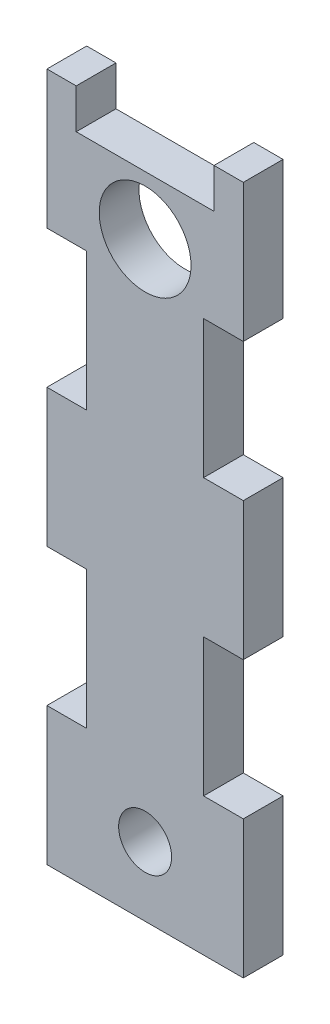
ISO-10303-21;
HEADER;
FILE_DESCRIPTION(('STEP AP214'),'2;1');
FILE_NAME('part.step','',(''),(''),'','','');
FILE_SCHEMA(('AUTOMOTIVE_DESIGN { 1 0 10303 214 1 1 1 1 }'));
ENDSEC;
DATA;
#1=APPLICATION_CONTEXT('core data for automotive mechanical design processes');
#2=APPLICATION_PROTOCOL_DEFINITION('international standard','automotive_design',2000,#1);
#3=PRODUCT_CONTEXT('',#1,'mechanical');
#4=PRODUCT('Part','Part','',(#3));
#5=PRODUCT_RELATED_PRODUCT_CATEGORY('part','',(#4));
#6=PRODUCT_DEFINITION_FORMATION('','',#4);
#7=PRODUCT_DEFINITION_CONTEXT('part definition',#1,'design');
#8=PRODUCT_DEFINITION('design','',#6,#7);
#9=PRODUCT_DEFINITION_SHAPE('','',#8);
#10=(LENGTH_UNIT() NAMED_UNIT(*) SI_UNIT(.MILLI.,.METRE.));
#11=(NAMED_UNIT(*) PLANE_ANGLE_UNIT() SI_UNIT($,.RADIAN.));
#12=(NAMED_UNIT(*) SI_UNIT($,.STERADIAN.) SOLID_ANGLE_UNIT());
#13=UNCERTAINTY_MEASURE_WITH_UNIT(LENGTH_MEASURE(1.E-05),#10,'distance_accuracy_value','');
#14=(GEOMETRIC_REPRESENTATION_CONTEXT(3) GLOBAL_UNCERTAINTY_ASSIGNED_CONTEXT((#13)) GLOBAL_UNIT_ASSIGNED_CONTEXT((#10,
#11,#12)) REPRESENTATION_CONTEXT('',''));
#15=CARTESIAN_POINT('',(0.,0.,0.));
#16=DIRECTION('',(0.,0.,1.));
#17=DIRECTION('',(1.,0.,0.));
#18=AXIS2_PLACEMENT_3D('',#15,#16,#17);
#19=CARTESIAN_POINT('',(0.,-9.525,9.525));
#20=DIRECTION('',(0.,1.,0.));
#21=DIRECTION('',(0.,0.,1.));
#22=AXIS2_PLACEMENT_3D('',#19,#20,#21);
#23=PLANE('',#22);
#24=DIRECTION('',(1.,0.,0.));
#25=VECTOR('',#24,1.);
#26=CARTESIAN_POINT('',(0.,-9.525,0.));
#27=LINE('',#26,#25);
#28=CARTESIAN_POINT('',(7.01499994,-9.525,0.));
#29=VERTEX_POINT('',#28);
#30=CARTESIAN_POINT('',(40.03499994,-9.525,0.));
#31=VERTEX_POINT('',#30);
#32=EDGE_CURVE('E238',#29,#31,#27,.T.);
#33=ORIENTED_EDGE('',*,*,#32,.F.);
#34=DIRECTION('',(0.,0.,-1.));
#35=VECTOR('',#34,1.);
#36=CARTESIAN_POINT('',(7.01499994,-9.525,9.525));
#37=LINE('',#36,#35);
#38=CARTESIAN_POINT('',(7.01499994,-9.525,9.525));
#39=VERTEX_POINT('',#38);
#40=EDGE_CURVE('E11',#39,#29,#37,.T.);
#41=ORIENTED_EDGE('',*,*,#40,.F.);
#42=DIRECTION('',(1.,0.,0.));
#43=VECTOR('',#42,1.);
#44=CARTESIAN_POINT('',(0.,-9.525,9.525));
#45=LINE('',#44,#43);
#46=CARTESIAN_POINT('',(40.03499994,-9.525,9.525));
#47=VERTEX_POINT('',#46);
#48=EDGE_CURVE('E421',#39,#47,#45,.T.);
#49=ORIENTED_EDGE('',*,*,#48,.T.);
#50=DIRECTION('',(0.,0.,-1.));
#51=VECTOR('',#50,1.);
#52=CARTESIAN_POINT('',(40.03499994,-9.525,9.525));
#53=LINE('',#52,#51);
#54=EDGE_CURVE('E139',#47,#31,#53,.T.);
#55=ORIENTED_EDGE('',*,*,#54,.T.);
#56=EDGE_LOOP('',(#33,#41,#49,#55));
#57=FACE_BOUND('',#56,.T.);
#58=ADVANCED_FACE('F38',(#57),#23,.T.);
#59=CARTESIAN_POINT('',(7.01499994,0.,9.525));
#60=DIRECTION('',(1.,0.,0.));
#61=DIRECTION('',(0.,1.,0.));
#62=AXIS2_PLACEMENT_3D('',#59,#60,#61);
#63=PLANE('',#62);
#64=DIRECTION('',(0.,-1.,0.));
#65=VECTOR('',#64,1.);
#66=CARTESIAN_POINT('',(7.01499994,0.,0.));
#67=LINE('',#66,#65);
#68=CARTESIAN_POINT('',(7.01499994,0.,0.));
#69=VERTEX_POINT('',#68);
#70=EDGE_CURVE('E242',#69,#29,#67,.T.);
#71=ORIENTED_EDGE('',*,*,#70,.F.);
#72=DIRECTION('',(0.,0.,-1.));
#73=VECTOR('',#72,1.);
#74=CARTESIAN_POINT('',(7.01499994,0.,9.525));
#75=LINE('',#74,#73);
#76=CARTESIAN_POINT('',(7.01499994,0.,9.525));
#77=VERTEX_POINT('',#76);
#78=EDGE_CURVE('E49',#77,#69,#75,.T.);
#79=ORIENTED_EDGE('',*,*,#78,.F.);
#80=DIRECTION('',(0.,-1.,0.));
#81=VECTOR('',#80,1.);
#82=CARTESIAN_POINT('',(7.01499994,0.,9.525));
#83=LINE('',#82,#81);
#84=EDGE_CURVE('E417',#77,#39,#83,.T.);
#85=ORIENTED_EDGE('',*,*,#84,.T.);
#86=ORIENTED_EDGE('',*,*,#40,.T.);
#87=EDGE_LOOP('',(#71,#79,#85,#86));
#88=FACE_BOUND('',#87,.T.);
#89=ADVANCED_FACE('F403',(#88),#63,.T.);
#90=CARTESIAN_POINT('',(0.,0.,9.525));
#91=DIRECTION('',(0.,1.,0.));
#92=DIRECTION('',(0.,0.,1.));
#93=AXIS2_PLACEMENT_3D('',#90,#91,#92);
#94=PLANE('',#93);
#95=DIRECTION('',(1.,0.,0.));
#96=VECTOR('',#95,1.);
#97=CARTESIAN_POINT('',(0.,0.,0.));
#98=LINE('',#97,#96);
#99=CARTESIAN_POINT('',(0.,0.,0.));
#100=VERTEX_POINT('',#99);
#101=EDGE_CURVE('E246',#100,#69,#98,.T.);
#102=ORIENTED_EDGE('',*,*,#101,.F.);
#103=DIRECTION('',(0.,0.,-1.));
#104=VECTOR('',#103,1.);
#105=CARTESIAN_POINT('',(0.,0.,9.525));
#106=LINE('',#105,#104);
#107=CARTESIAN_POINT('',(0.,0.,9.525));
#108=VERTEX_POINT('',#107);
#109=EDGE_CURVE('E389',#108,#100,#106,.T.);
#110=ORIENTED_EDGE('',*,*,#109,.F.);
#111=DIRECTION('',(1.,0.,0.));
#112=VECTOR('',#111,1.);
#113=CARTESIAN_POINT('',(0.,0.,9.525));
#114=LINE('',#113,#112);
#115=EDGE_CURVE('E399',#108,#77,#114,.T.);
#116=ORIENTED_EDGE('',*,*,#115,.T.);
#117=ORIENTED_EDGE('',*,*,#78,.T.);
#118=EDGE_LOOP('',(#102,#110,#116,#117));
#119=FACE_BOUND('',#118,.T.);
#120=ADVANCED_FACE('F397',(#119),#94,.T.);
#121=CARTESIAN_POINT('',(0.,0.,9.525));
#122=DIRECTION('',(1.,0.,0.));
#123=DIRECTION('',(0.,1.,0.));
#124=AXIS2_PLACEMENT_3D('',#121,#122,#123);
#125=PLANE('',#124);
#126=DIRECTION('',(0.,-1.,0.));
#127=VECTOR('',#126,1.);
#128=CARTESIAN_POINT('',(0.,0.,0.));
#129=LINE('',#128,#127);
#130=CARTESIAN_POINT('',(0.,-33.02,0.));
#131=VERTEX_POINT('',#130);
#132=EDGE_CURVE('E250',#100,#131,#129,.T.);
#133=ORIENTED_EDGE('',*,*,#132,.T.);
#134=DIRECTION('',(0.,0.,-1.));
#135=VECTOR('',#134,1.);
#136=CARTESIAN_POINT('',(0.,-33.02,9.525));
#137=LINE('',#136,#135);
#138=CARTESIAN_POINT('',(0.,-33.02,9.525));
#139=VERTEX_POINT('',#138);
#140=EDGE_CURVE('E385',#139,#131,#137,.T.);
#141=ORIENTED_EDGE('',*,*,#140,.F.);
#142=DIRECTION('',(0.,-1.,0.));
#143=VECTOR('',#142,1.);
#144=CARTESIAN_POINT('',(0.,0.,9.525));
#145=LINE('',#144,#143);
#146=EDGE_CURVE('E412',#108,#139,#145,.T.);
#147=ORIENTED_EDGE('',*,*,#146,.F.);
#148=ORIENTED_EDGE('',*,*,#109,.T.);
#149=EDGE_LOOP('',(#133,#141,#147,#148));
#150=FACE_BOUND('',#149,.T.);
#151=ADVANCED_FACE('F409',(#150),#125,.F.);
#152=CARTESIAN_POINT('',(0.,-33.02,9.525));
#153=DIRECTION('',(0.,1.,0.));
#154=DIRECTION('',(0.,0.,1.));
#155=AXIS2_PLACEMENT_3D('',#152,#153,#154);
#156=PLANE('',#155);
#157=DIRECTION('',(1.,0.,0.));
#158=VECTOR('',#157,1.);
#159=CARTESIAN_POINT('',(0.,-33.02,0.));
#160=LINE('',#159,#158);
#161=CARTESIAN_POINT('',(9.525,-33.02,0.));
#162=VERTEX_POINT('',#161);
#163=EDGE_CURVE('E254',#131,#162,#160,.T.);
#164=ORIENTED_EDGE('',*,*,#163,.T.);
#165=DIRECTION('',(0.,0.,-1.));
#166=VECTOR('',#165,1.);
#167=CARTESIAN_POINT('',(9.525,-33.02,9.525));
#168=LINE('',#167,#166);
#169=CARTESIAN_POINT('',(9.525,-33.02,9.525));
#170=VERTEX_POINT('',#169);
#171=EDGE_CURVE('E381',#170,#162,#168,.T.);
#172=ORIENTED_EDGE('',*,*,#171,.F.);
#173=DIRECTION('',(1.,0.,0.));
#174=VECTOR('',#173,1.);
#175=CARTESIAN_POINT('',(0.,-33.02,9.525));
#176=LINE('',#175,#174);
#177=EDGE_CURVE('E415',#139,#170,#176,.T.);
#178=ORIENTED_EDGE('',*,*,#177,.F.);
#179=ORIENTED_EDGE('',*,*,#140,.T.);
#180=EDGE_LOOP('',(#164,#172,#178,#179));
#181=FACE_BOUND('',#180,.T.);
#182=ADVANCED_FACE('F519',(#181),#156,.F.);
#183=CARTESIAN_POINT('',(9.525,0.,9.525));
#184=DIRECTION('',(1.,0.,0.));
#185=DIRECTION('',(0.,1.,0.));
#186=AXIS2_PLACEMENT_3D('',#183,#184,#185);
#187=PLANE('',#186);
#188=DIRECTION('',(0.,-1.,0.));
#189=VECTOR('',#188,1.);
#190=CARTESIAN_POINT('',(9.525,0.,0.));
#191=LINE('',#190,#189);
#192=CARTESIAN_POINT('',(9.52500000000001,-66.04,0.));
#193=VERTEX_POINT('',#192);
#194=EDGE_CURVE('E258',#162,#193,#191,.T.);
#195=ORIENTED_EDGE('',*,*,#194,.T.);
#196=DIRECTION('',(0.,0.,-1.));
#197=VECTOR('',#196,1.);
#198=CARTESIAN_POINT('',(9.52500000000001,-66.04,9.525));
#199=LINE('',#198,#197);
#200=CARTESIAN_POINT('',(9.52500000000001,-66.04,9.525));
#201=VERTEX_POINT('',#200);
#202=EDGE_CURVE('E377',#201,#193,#199,.T.);
#203=ORIENTED_EDGE('',*,*,#202,.F.);
#204=DIRECTION('',(0.,-1.,0.));
#205=VECTOR('',#204,1.);
#206=CARTESIAN_POINT('',(9.525,0.,9.525));
#207=LINE('',#206,#205);
#208=EDGE_CURVE('E427',#170,#201,#207,.T.);
#209=ORIENTED_EDGE('',*,*,#208,.F.);
#210=ORIENTED_EDGE('',*,*,#171,.T.);
#211=EDGE_LOOP('',(#195,#203,#209,#210));
#212=FACE_BOUND('',#211,.T.);
#213=ADVANCED_FACE('F522',(#212),#187,.F.);
#214=CARTESIAN_POINT('',(0.,-66.04,9.525));
#215=DIRECTION('',(0.,-1.,0.));
#216=DIRECTION('',(0.,0.,-1.));
#217=AXIS2_PLACEMENT_3D('',#214,#215,#216);
#218=PLANE('',#217);
#219=DIRECTION('',(-1.,0.,0.));
#220=VECTOR('',#219,1.);
#221=CARTESIAN_POINT('',(0.,-66.04,0.));
#222=LINE('',#221,#220);
#223=CARTESIAN_POINT('',(0.,-66.04,0.));
#224=VERTEX_POINT('',#223);
#225=EDGE_CURVE('E262',#193,#224,#222,.T.);
#226=ORIENTED_EDGE('',*,*,#225,.T.);
#227=DIRECTION('',(0.,0.,-1.));
#228=VECTOR('',#227,1.);
#229=CARTESIAN_POINT('',(0.,-66.04,9.525));
#230=LINE('',#229,#228);
#231=CARTESIAN_POINT('',(0.,-66.04,9.525));
#232=VERTEX_POINT('',#231);
#233=EDGE_CURVE('E373',#232,#224,#230,.T.);
#234=ORIENTED_EDGE('',*,*,#233,.F.);
#235=DIRECTION('',(-1.,0.,0.));
#236=VECTOR('',#235,1.);
#237=CARTESIAN_POINT('',(0.,-66.04,9.525));
#238=LINE('',#237,#236);
#239=EDGE_CURVE('E431',#201,#232,#238,.T.);
#240=ORIENTED_EDGE('',*,*,#239,.F.);
#241=ORIENTED_EDGE('',*,*,#202,.T.);
#242=EDGE_LOOP('',(#226,#234,#240,#241));
#243=FACE_BOUND('',#242,.T.);
#244=ADVANCED_FACE('F526',(#243),#218,.F.);
#245=CARTESIAN_POINT('',(0.,0.,9.525));
#246=DIRECTION('',(1.,0.,0.));
#247=DIRECTION('',(0.,1.,0.));
#248=AXIS2_PLACEMENT_3D('',#245,#246,#247);
#249=PLANE('',#248);
#250=DIRECTION('',(0.,-1.,0.));
#251=VECTOR('',#250,1.);
#252=CARTESIAN_POINT('',(0.,0.,0.));
#253=LINE('',#252,#251);
#254=CARTESIAN_POINT('',(0.,-99.06,0.));
#255=VERTEX_POINT('',#254);
#256=EDGE_CURVE('E266',#224,#255,#253,.T.);
#257=ORIENTED_EDGE('',*,*,#256,.T.);
#258=DIRECTION('',(0.,0.,-1.));
#259=VECTOR('',#258,1.);
#260=CARTESIAN_POINT('',(0.,-99.06,9.525));
#261=LINE('',#260,#259);
#262=CARTESIAN_POINT('',(0.,-99.06,9.525));
#263=VERTEX_POINT('',#262);
#264=EDGE_CURVE('E370',#263,#255,#261,.T.);
#265=ORIENTED_EDGE('',*,*,#264,.F.);
#266=DIRECTION('',(0.,-1.,0.));
#267=VECTOR('',#266,1.);
#268=CARTESIAN_POINT('',(0.,0.,9.525));
#269=LINE('',#268,#267);
#270=EDGE_CURVE('E435',#232,#263,#269,.T.);
#271=ORIENTED_EDGE('',*,*,#270,.F.);
#272=ORIENTED_EDGE('',*,*,#233,.T.);
#273=EDGE_LOOP('',(#257,#265,#271,#272));
#274=FACE_BOUND('',#273,.T.);
#275=ADVANCED_FACE('F530',(#274),#249,.F.);
#276=CARTESIAN_POINT('',(0.,-99.06,9.525));
#277=DIRECTION('',(0.,-1.,0.));
#278=DIRECTION('',(0.,0.,-1.));
#279=AXIS2_PLACEMENT_3D('',#276,#277,#278);
#280=PLANE('',#279);
#281=DIRECTION('',(-1.,0.,0.));
#282=VECTOR('',#281,1.);
#283=CARTESIAN_POINT('',(0.,-99.06,0.));
#284=LINE('',#283,#282);
#285=CARTESIAN_POINT('',(9.52500000000002,-99.06,0.));
#286=VERTEX_POINT('',#285);
#287=EDGE_CURVE('E270',#286,#255,#284,.T.);
#288=ORIENTED_EDGE('',*,*,#287,.F.);
#289=DIRECTION('',(0.,0.,-1.));
#290=VECTOR('',#289,1.);
#291=CARTESIAN_POINT('',(9.52500000000002,-99.06,9.525));
#292=LINE('',#291,#290);
#293=CARTESIAN_POINT('',(9.52500000000002,-99.06,9.525));
#294=VERTEX_POINT('',#293);
#295=EDGE_CURVE('E367',#294,#286,#292,.T.);
#296=ORIENTED_EDGE('',*,*,#295,.F.);
#297=DIRECTION('',(-1.,0.,0.));
#298=VECTOR('',#297,1.);
#299=CARTESIAN_POINT('',(0.,-99.06,9.525));
#300=LINE('',#299,#298);
#301=EDGE_CURVE('E438',#294,#263,#300,.T.);
#302=ORIENTED_EDGE('',*,*,#301,.T.);
#303=ORIENTED_EDGE('',*,*,#264,.T.);
#304=EDGE_LOOP('',(#288,#296,#302,#303));
#305=FACE_BOUND('',#304,.T.);
#306=ADVANCED_FACE('F532',(#305),#280,.T.);
#307=CARTESIAN_POINT('',(9.52500000000002,0.,9.525));
#308=DIRECTION('',(-1.,0.,0.));
#309=DIRECTION('',(0.,0.,1.));
#310=AXIS2_PLACEMENT_3D('',#307,#308,#309);
#311=PLANE('',#310);
#312=DIRECTION('',(0.,1.,0.));
#313=VECTOR('',#312,1.);
#314=CARTESIAN_POINT('',(9.52500000000002,0.,0.));
#315=LINE('',#314,#313);
#316=CARTESIAN_POINT('',(9.52500000000002,-132.08,0.));
#317=VERTEX_POINT('',#316);
#318=EDGE_CURVE('E275',#317,#286,#315,.T.);
#319=ORIENTED_EDGE('',*,*,#318,.F.);
#320=DIRECTION('',(0.,0.,-1.));
#321=VECTOR('',#320,1.);
#322=CARTESIAN_POINT('',(9.52500000000002,-132.08,9.525));
#323=LINE('',#322,#321);
#324=CARTESIAN_POINT('',(9.52500000000002,-132.08,9.525));
#325=VERTEX_POINT('',#324);
#326=EDGE_CURVE('E364',#325,#317,#323,.T.);
#327=ORIENTED_EDGE('',*,*,#326,.F.);
#328=DIRECTION('',(0.,1.,0.));
#329=VECTOR('',#328,1.);
#330=CARTESIAN_POINT('',(9.52500000000002,0.,9.525));
#331=LINE('',#330,#329);
#332=EDGE_CURVE('E443',#325,#294,#331,.T.);
#333=ORIENTED_EDGE('',*,*,#332,.T.);
#334=ORIENTED_EDGE('',*,*,#295,.T.);
#335=EDGE_LOOP('',(#319,#327,#333,#334));
#336=FACE_BOUND('',#335,.T.);
#337=ADVANCED_FACE('F535',(#336),#311,.T.);
#338=CARTESIAN_POINT('',(0.,-132.08,9.525));
#339=DIRECTION('',(0.,1.,0.));
#340=DIRECTION('',(0.,0.,1.));
#341=AXIS2_PLACEMENT_3D('',#338,#339,#340);
#342=PLANE('',#341);
#343=DIRECTION('',(1.,0.,0.));
#344=VECTOR('',#343,1.);
#345=CARTESIAN_POINT('',(0.,-132.08,0.));
#346=LINE('',#345,#344);
#347=CARTESIAN_POINT('',(0.,-132.08,0.));
#348=VERTEX_POINT('',#347);
#349=EDGE_CURVE('E279',#348,#317,#346,.T.);
#350=ORIENTED_EDGE('',*,*,#349,.F.);
#351=DIRECTION('',(0.,0.,-1.));
#352=VECTOR('',#351,1.);
#353=CARTESIAN_POINT('',(0.,-132.08,9.525));
#354=LINE('',#353,#352);
#355=CARTESIAN_POINT('',(0.,-132.08,9.525));
#356=VERTEX_POINT('',#355);
#357=EDGE_CURVE('E361',#356,#348,#354,.T.);
#358=ORIENTED_EDGE('',*,*,#357,.F.);
#359=DIRECTION('',(1.,0.,0.));
#360=VECTOR('',#359,1.);
#361=CARTESIAN_POINT('',(0.,-132.08,9.525));
#362=LINE('',#361,#360);
#363=EDGE_CURVE('E447',#356,#325,#362,.T.);
#364=ORIENTED_EDGE('',*,*,#363,.T.);
#365=ORIENTED_EDGE('',*,*,#326,.T.);
#366=EDGE_LOOP('',(#350,#358,#364,#365));
#367=FACE_BOUND('',#366,.T.);
#368=ADVANCED_FACE('F539',(#367),#342,.T.);
#369=CARTESIAN_POINT('',(0.,-165.1,0.));
#370=VERTEX_POINT('',#369);
#371=EDGE_CURVE('E271',#348,#370,#253,.T.);
#372=ORIENTED_EDGE('',*,*,#371,.T.);
#373=DIRECTION('',(0.,0.,-1.));
#374=VECTOR('',#373,1.);
#375=CARTESIAN_POINT('',(0.,-165.1,9.525));
#376=LINE('',#375,#374);
#377=CARTESIAN_POINT('',(0.,-165.1,9.525));
#378=VERTEX_POINT('',#377);
#379=EDGE_CURVE('E357',#378,#370,#376,.T.);
#380=ORIENTED_EDGE('',*,*,#379,.F.);
#381=EDGE_CURVE('E439',#356,#378,#269,.T.);
#382=ORIENTED_EDGE('',*,*,#381,.F.);
#383=ORIENTED_EDGE('',*,*,#357,.T.);
#384=EDGE_LOOP('',(#372,#380,#382,#383));
#385=FACE_BOUND('',#384,.T.);
#386=ADVANCED_FACE('F543',(#385),#249,.F.);
#387=CARTESIAN_POINT('',(0.,-165.1,9.525));
#388=DIRECTION('',(0.,1.,0.));
#389=DIRECTION('',(0.,0.,1.));
#390=AXIS2_PLACEMENT_3D('',#387,#388,#389);
#391=PLANE('',#390);
#392=DIRECTION('',(1.,0.,0.));
#393=VECTOR('',#392,1.);
#394=CARTESIAN_POINT('',(0.,-165.1,0.));
#395=LINE('',#394,#393);
#396=CARTESIAN_POINT('',(47.05,-165.1,0.));
#397=VERTEX_POINT('',#396);
#398=EDGE_CURVE('E283',#370,#397,#395,.T.);
#399=ORIENTED_EDGE('',*,*,#398,.T.);
#400=DIRECTION('',(0.,0.,-1.));
#401=VECTOR('',#400,1.);
#402=CARTESIAN_POINT('',(47.05,-165.1,9.525));
#403=LINE('',#402,#401);
#404=CARTESIAN_POINT('',(47.05,-165.1,9.525));
#405=VERTEX_POINT('',#404);
#406=EDGE_CURVE('E354',#405,#397,#403,.T.);
#407=ORIENTED_EDGE('',*,*,#406,.F.);
#408=DIRECTION('',(1.,0.,0.));
#409=VECTOR('',#408,1.);
#410=CARTESIAN_POINT('',(0.,-165.1,9.525));
#411=LINE('',#410,#409);
#412=EDGE_CURVE('E451',#378,#405,#411,.T.);
#413=ORIENTED_EDGE('',*,*,#412,.F.);
#414=ORIENTED_EDGE('',*,*,#379,.T.);
#415=EDGE_LOOP('',(#399,#407,#413,#414));
#416=FACE_BOUND('',#415,.T.);
#417=ADVANCED_FACE('F547',(#416),#391,.F.);
#418=CARTESIAN_POINT('',(47.05,0.,9.525));
#419=DIRECTION('',(1.,0.,0.));
#420=DIRECTION('',(0.,1.,0.));
#421=AXIS2_PLACEMENT_3D('',#418,#419,#420);
#422=PLANE('',#421);
#423=DIRECTION('',(0.,-1.,0.));
#424=VECTOR('',#423,1.);
#425=CARTESIAN_POINT('',(47.05,0.,0.));
#426=LINE('',#425,#424);
#427=CARTESIAN_POINT('',(47.05,-132.08,0.));
#428=VERTEX_POINT('',#427);
#429=EDGE_CURVE('E287',#428,#397,#426,.T.);
#430=ORIENTED_EDGE('',*,*,#429,.F.);
#431=DIRECTION('',(0.,0.,-1.));
#432=VECTOR('',#431,1.);
#433=CARTESIAN_POINT('',(47.05,-132.08,9.525));
#434=LINE('',#433,#432);
#435=CARTESIAN_POINT('',(47.05,-132.08,9.525));
#436=VERTEX_POINT('',#435);
#437=EDGE_CURVE('E351',#436,#428,#434,.T.);
#438=ORIENTED_EDGE('',*,*,#437,.F.);
#439=DIRECTION('',(0.,-1.,0.));
#440=VECTOR('',#439,1.);
#441=CARTESIAN_POINT('',(47.05,0.,9.525));
#442=LINE('',#441,#440);
#443=EDGE_CURVE('E454',#436,#405,#442,.T.);
#444=ORIENTED_EDGE('',*,*,#443,.T.);
#445=ORIENTED_EDGE('',*,*,#406,.T.);
#446=EDGE_LOOP('',(#430,#438,#444,#445));
#447=FACE_BOUND('',#446,.T.);
#448=ADVANCED_FACE('F551',(#447),#422,.T.);
#449=CARTESIAN_POINT('',(0.,-132.08,9.525));
#450=DIRECTION('',(0.,-1.,0.));
#451=DIRECTION('',(0.,0.,-1.));
#452=AXIS2_PLACEMENT_3D('',#449,#450,#451);
#453=PLANE('',#452);
#454=DIRECTION('',(-1.,0.,0.));
#455=VECTOR('',#454,1.);
#456=CARTESIAN_POINT('',(0.,-132.08,0.));
#457=LINE('',#456,#455);
#458=CARTESIAN_POINT('',(37.525,-132.08,0.));
#459=VERTEX_POINT('',#458);
#460=EDGE_CURVE('E291',#428,#459,#457,.T.);
#461=ORIENTED_EDGE('',*,*,#460,.T.);
#462=DIRECTION('',(0.,0.,-1.));
#463=VECTOR('',#462,1.);
#464=CARTESIAN_POINT('',(37.525,-132.08,9.525));
#465=LINE('',#464,#463);
#466=CARTESIAN_POINT('',(37.525,-132.08,9.525));
#467=VERTEX_POINT('',#466);
#468=EDGE_CURVE('E347',#467,#459,#465,.T.);
#469=ORIENTED_EDGE('',*,*,#468,.F.);
#470=DIRECTION('',(-1.,0.,0.));
#471=VECTOR('',#470,1.);
#472=CARTESIAN_POINT('',(0.,-132.08,9.525));
#473=LINE('',#472,#471);
#474=EDGE_CURVE('E458',#436,#467,#473,.T.);
#475=ORIENTED_EDGE('',*,*,#474,.F.);
#476=ORIENTED_EDGE('',*,*,#437,.T.);
#477=EDGE_LOOP('',(#461,#469,#475,#476));
#478=FACE_BOUND('',#477,.T.);
#479=ADVANCED_FACE('F553',(#478),#453,.F.);
#480=CARTESIAN_POINT('',(37.525,0.,9.525));
#481=DIRECTION('',(-1.,0.,0.));
#482=DIRECTION('',(0.,-1.,0.));
#483=AXIS2_PLACEMENT_3D('',#480,#481,#482);
#484=PLANE('',#483);
#485=DIRECTION('',(0.,1.,0.));
#486=VECTOR('',#485,1.);
#487=CARTESIAN_POINT('',(37.525,0.,0.));
#488=LINE('',#487,#486);
#489=CARTESIAN_POINT('',(37.525,-99.06,0.));
#490=VERTEX_POINT('',#489);
#491=EDGE_CURVE('E296',#459,#490,#488,.T.);
#492=ORIENTED_EDGE('',*,*,#491,.T.);
#493=DIRECTION('',(0.,0.,-1.));
#494=VECTOR('',#493,1.);
#495=CARTESIAN_POINT('',(37.525,-99.06,9.525));
#496=LINE('',#495,#494);
#497=CARTESIAN_POINT('',(37.525,-99.06,9.525));
#498=VERTEX_POINT('',#497);
#499=EDGE_CURVE('E343',#498,#490,#496,.T.);
#500=ORIENTED_EDGE('',*,*,#499,.F.);
#501=DIRECTION('',(0.,1.,0.));
#502=VECTOR('',#501,1.);
#503=CARTESIAN_POINT('',(37.525,0.,9.525));
#504=LINE('',#503,#502);
#505=EDGE_CURVE('E463',#467,#498,#504,.T.);
#506=ORIENTED_EDGE('',*,*,#505,.F.);
#507=ORIENTED_EDGE('',*,*,#468,.T.);
#508=EDGE_LOOP('',(#492,#500,#506,#507));
#509=FACE_BOUND('',#508,.T.);
#510=ADVANCED_FACE('F556',(#509),#484,.F.);
#511=CARTESIAN_POINT('',(0.,-99.06,9.525));
#512=DIRECTION('',(0.,1.,0.));
#513=DIRECTION('',(0.,0.,1.));
#514=AXIS2_PLACEMENT_3D('',#511,#512,#513);
#515=PLANE('',#514);
#516=DIRECTION('',(1.,0.,0.));
#517=VECTOR('',#516,1.);
#518=CARTESIAN_POINT('',(0.,-99.06,0.));
#519=LINE('',#518,#517);
#520=CARTESIAN_POINT('',(47.05,-99.06,0.));
#521=VERTEX_POINT('',#520);
#522=EDGE_CURVE('E300',#490,#521,#519,.T.);
#523=ORIENTED_EDGE('',*,*,#522,.T.);
#524=DIRECTION('',(0.,0.,-1.));
#525=VECTOR('',#524,1.);
#526=CARTESIAN_POINT('',(47.05,-99.06,9.525));
#527=LINE('',#526,#525);
#528=CARTESIAN_POINT('',(47.05,-99.06,9.525));
#529=VERTEX_POINT('',#528);
#530=EDGE_CURVE('E340',#529,#521,#527,.T.);
#531=ORIENTED_EDGE('',*,*,#530,.F.);
#532=DIRECTION('',(1.,0.,0.));
#533=VECTOR('',#532,1.);
#534=CARTESIAN_POINT('',(0.,-99.06,9.525));
#535=LINE('',#534,#533);
#536=EDGE_CURVE('E467',#498,#529,#535,.T.);
#537=ORIENTED_EDGE('',*,*,#536,.F.);
#538=ORIENTED_EDGE('',*,*,#499,.T.);
#539=EDGE_LOOP('',(#523,#531,#537,#538));
#540=FACE_BOUND('',#539,.T.);
#541=ADVANCED_FACE('F560',(#540),#515,.F.);
#542=CARTESIAN_POINT('',(47.05,-66.04,0.));
#543=VERTEX_POINT('',#542);
#544=EDGE_CURVE('E292',#543,#521,#426,.T.);
#545=ORIENTED_EDGE('',*,*,#544,.F.);
#546=DIRECTION('',(0.,0.,-1.));
#547=VECTOR('',#546,1.);
#548=CARTESIAN_POINT('',(47.05,-66.04,9.525));
#549=LINE('',#548,#547);
#550=CARTESIAN_POINT('',(47.05,-66.04,9.525));
#551=VERTEX_POINT('',#550);
#552=EDGE_CURVE('E337',#551,#543,#549,.T.);
#553=ORIENTED_EDGE('',*,*,#552,.F.);
#554=EDGE_CURVE('E459',#551,#529,#442,.T.);
#555=ORIENTED_EDGE('',*,*,#554,.T.);
#556=ORIENTED_EDGE('',*,*,#530,.T.);
#557=EDGE_LOOP('',(#545,#553,#555,#556));
#558=FACE_BOUND('',#557,.T.);
#559=ADVANCED_FACE('F564',(#558),#422,.T.);
#560=CARTESIAN_POINT('',(0.,-66.04,9.525));
#561=DIRECTION('',(0.,1.,0.));
#562=DIRECTION('',(0.,0.,1.));
#563=AXIS2_PLACEMENT_3D('',#560,#561,#562);
#564=PLANE('',#563);
#565=DIRECTION('',(1.,0.,0.));
#566=VECTOR('',#565,1.);
#567=CARTESIAN_POINT('',(0.,-66.04,0.));
#568=LINE('',#567,#566);
#569=CARTESIAN_POINT('',(37.525,-66.04,0.));
#570=VERTEX_POINT('',#569);
#571=EDGE_CURVE('E304',#570,#543,#568,.T.);
#572=ORIENTED_EDGE('',*,*,#571,.F.);
#573=DIRECTION('',(0.,0.,-1.));
#574=VECTOR('',#573,1.);
#575=CARTESIAN_POINT('',(37.525,-66.04,9.525));
#576=LINE('',#575,#574);
#577=CARTESIAN_POINT('',(37.525,-66.04,9.525));
#578=VERTEX_POINT('',#577);
#579=EDGE_CURVE('E334',#578,#570,#576,.T.);
#580=ORIENTED_EDGE('',*,*,#579,.F.);
#581=DIRECTION('',(1.,0.,0.));
#582=VECTOR('',#581,1.);
#583=CARTESIAN_POINT('',(0.,-66.04,9.525));
#584=LINE('',#583,#582);
#585=EDGE_CURVE('E470',#578,#551,#584,.T.);
#586=ORIENTED_EDGE('',*,*,#585,.T.);
#587=ORIENTED_EDGE('',*,*,#552,.T.);
#588=EDGE_LOOP('',(#572,#580,#586,#587));
#589=FACE_BOUND('',#588,.T.);
#590=ADVANCED_FACE('F568',(#589),#564,.T.);
#591=CARTESIAN_POINT('',(37.525,0.,9.525));
#592=DIRECTION('',(1.,0.,0.));
#593=DIRECTION('',(0.,1.,0.));
#594=AXIS2_PLACEMENT_3D('',#591,#592,#593);
#595=PLANE('',#594);
#596=DIRECTION('',(0.,-1.,0.));
#597=VECTOR('',#596,1.);
#598=CARTESIAN_POINT('',(37.525,0.,0.));
#599=LINE('',#598,#597);
#600=CARTESIAN_POINT('',(37.525,-33.02,0.));
#601=VERTEX_POINT('',#600);
#602=EDGE_CURVE('E308',#601,#570,#599,.T.);
#603=ORIENTED_EDGE('',*,*,#602,.F.);
#604=DIRECTION('',(0.,0.,-1.));
#605=VECTOR('',#604,1.);
#606=CARTESIAN_POINT('',(37.525,-33.02,9.525));
#607=LINE('',#606,#605);
#608=CARTESIAN_POINT('',(37.525,-33.02,9.525));
#609=VERTEX_POINT('',#608);
#610=EDGE_CURVE('E331',#609,#601,#607,.T.);
#611=ORIENTED_EDGE('',*,*,#610,.F.);
#612=DIRECTION('',(0.,-1.,0.));
#613=VECTOR('',#612,1.);
#614=CARTESIAN_POINT('',(37.525,0.,9.525));
#615=LINE('',#614,#613);
#616=EDGE_CURVE('E474',#609,#578,#615,.T.);
#617=ORIENTED_EDGE('',*,*,#616,.T.);
#618=ORIENTED_EDGE('',*,*,#579,.T.);
#619=EDGE_LOOP('',(#603,#611,#617,#618));
#620=FACE_BOUND('',#619,.T.);
#621=ADVANCED_FACE('F572',(#620),#595,.T.);
#622=CARTESIAN_POINT('',(0.,-33.02,9.525));
#623=DIRECTION('',(0.,-1.,0.));
#624=DIRECTION('',(0.,0.,-1.));
#625=AXIS2_PLACEMENT_3D('',#622,#623,#624);
#626=PLANE('',#625);
#627=DIRECTION('',(-1.,0.,0.));
#628=VECTOR('',#627,1.);
#629=CARTESIAN_POINT('',(0.,-33.02,0.));
#630=LINE('',#629,#628);
#631=CARTESIAN_POINT('',(47.05,-33.02,0.));
#632=VERTEX_POINT('',#631);
#633=EDGE_CURVE('E312',#632,#601,#630,.T.);
#634=ORIENTED_EDGE('',*,*,#633,.F.);
#635=DIRECTION('',(0.,0.,-1.));
#636=VECTOR('',#635,1.);
#637=CARTESIAN_POINT('',(47.05,-33.02,9.525));
#638=LINE('',#637,#636);
#639=CARTESIAN_POINT('',(47.05,-33.02,9.525));
#640=VERTEX_POINT('',#639);
#641=EDGE_CURVE('E217',#640,#632,#638,.T.);
#642=ORIENTED_EDGE('',*,*,#641,.F.);
#643=DIRECTION('',(-1.,0.,0.));
#644=VECTOR('',#643,1.);
#645=CARTESIAN_POINT('',(0.,-33.02,9.525));
#646=LINE('',#645,#644);
#647=EDGE_CURVE('E224',#640,#609,#646,.T.);
#648=ORIENTED_EDGE('',*,*,#647,.T.);
#649=ORIENTED_EDGE('',*,*,#610,.T.);
#650=EDGE_LOOP('',(#634,#642,#648,#649));
#651=FACE_BOUND('',#650,.T.);
#652=ADVANCED_FACE('F480',(#651),#626,.T.);
#653=CARTESIAN_POINT('',(47.05,0.,9.525));
#654=DIRECTION('',(1.,0.,0.));
#655=DIRECTION('',(0.,1.,0.));
#656=AXIS2_PLACEMENT_3D('',#653,#654,#655);
#657=PLANE('',#656);
#658=DIRECTION('',(0.,-1.,0.));
#659=VECTOR('',#658,1.);
#660=CARTESIAN_POINT('',(47.05,0.,0.));
#661=LINE('',#660,#659);
#662=CARTESIAN_POINT('',(47.05,0.,0.));
#663=VERTEX_POINT('',#662);
#664=EDGE_CURVE('E211',#663,#632,#661,.T.);
#665=ORIENTED_EDGE('',*,*,#664,.F.);
#666=DIRECTION('',(0.,0.,-1.));
#667=VECTOR('',#666,1.);
#668=CARTESIAN_POINT('',(47.05,0.,9.525));
#669=LINE('',#668,#667);
#670=CARTESIAN_POINT('',(47.05,0.,9.525));
#671=VERTEX_POINT('',#670);
#672=EDGE_CURVE('E206',#671,#663,#669,.T.);
#673=ORIENTED_EDGE('',*,*,#672,.F.);
#674=DIRECTION('',(0.,-1.,0.));
#675=VECTOR('',#674,1.);
#676=CARTESIAN_POINT('',(47.05,0.,9.525));
#677=LINE('',#676,#675);
#678=EDGE_CURVE('E209',#671,#640,#677,.T.);
#679=ORIENTED_EDGE('',*,*,#678,.T.);
#680=ORIENTED_EDGE('',*,*,#641,.T.);
#681=EDGE_LOOP('',(#665,#673,#679,#680));
#682=FACE_BOUND('',#681,.T.);
#683=ADVANCED_FACE('F208',(#682),#657,.T.);
#684=CARTESIAN_POINT('',(0.,0.,9.525));
#685=DIRECTION('',(0.,1.,0.));
#686=DIRECTION('',(0.,0.,1.));
#687=AXIS2_PLACEMENT_3D('',#684,#685,#686);
#688=PLANE('',#687);
#689=DIRECTION('',(1.,0.,0.));
#690=VECTOR('',#689,1.);
#691=CARTESIAN_POINT('',(0.,0.,0.));
#692=LINE('',#691,#690);
#693=CARTESIAN_POINT('',(40.03499994,0.,0.));
#694=VERTEX_POINT('',#693);
#695=EDGE_CURVE('E318',#694,#663,#692,.T.);
#696=ORIENTED_EDGE('',*,*,#695,.F.);
#697=DIRECTION('',(0.,0.,-1.));
#698=VECTOR('',#697,1.);
#699=CARTESIAN_POINT('',(40.03499994,0.,9.525));
#700=LINE('',#699,#698);
#701=CARTESIAN_POINT('',(40.03499994,0.,9.525));
#702=VERTEX_POINT('',#701);
#703=EDGE_CURVE('E132',#702,#694,#700,.T.);
#704=ORIENTED_EDGE('',*,*,#703,.F.);
#705=DIRECTION('',(1.,0.,0.));
#706=VECTOR('',#705,1.);
#707=CARTESIAN_POINT('',(0.,0.,9.525));
#708=LINE('',#707,#706);
#709=EDGE_CURVE('E221',#702,#671,#708,.T.);
#710=ORIENTED_EDGE('',*,*,#709,.T.);
#711=ORIENTED_EDGE('',*,*,#672,.T.);
#712=EDGE_LOOP('',(#696,#704,#710,#711));
#713=FACE_BOUND('',#712,.T.);
#714=ADVANCED_FACE('F227',(#713),#688,.T.);
#715=CARTESIAN_POINT('',(23.525,-23.525,9.525));
#716=DIRECTION('',(0.,0.,-1.));
#717=DIRECTION('',(-1.,0.,0.));
#718=AXIS2_PLACEMENT_3D('',#715,#716,#717);
#719=CYLINDRICAL_SURFACE('',#718,11.);
#720=CARTESIAN_POINT('',(23.525,-23.525,9.525));
#721=DIRECTION('',(0.,0.,1.));
#722=DIRECTION('',(1.,0.,0.));
#723=AXIS2_PLACEMENT_3D('',#720,#721,#722);
#724=CIRCLE('',#723,11.);
#725=CARTESIAN_POINT('',(34.525,-23.525,9.525));
#726=VERTEX_POINT('',#725);
#727=EDGE_CURVE('E324',#726,#726,#724,.T.);
#728=ORIENTED_EDGE('',*,*,#727,.T.);
#729=EDGE_LOOP('',(#728));
#730=FACE_BOUND('',#729,.T.);
#731=CARTESIAN_POINT('',(23.525,-23.525,0.));
#732=DIRECTION('',(0.,0.,1.));
#733=DIRECTION('',(1.,0.,0.));
#734=AXIS2_PLACEMENT_3D('',#731,#732,#733);
#735=CIRCLE('',#734,11.);
#736=CARTESIAN_POINT('',(34.525,-23.525,0.));
#737=VERTEX_POINT('',#736);
#738=EDGE_CURVE('E234',#737,#737,#735,.T.);
#739=ORIENTED_EDGE('',*,*,#738,.F.);
#740=EDGE_LOOP('',(#739));
#741=FACE_BOUND('',#740,.T.);
#742=ADVANCED_FACE('F40',(#730,#741),#719,.F.);
#743=CARTESIAN_POINT('',(40.03499994,0.,9.525));
#744=DIRECTION('',(1.,0.,0.));
#745=DIRECTION('',(0.,0.,-1.));
#746=AXIS2_PLACEMENT_3D('',#743,#744,#745);
#747=PLANE('',#746);
#748=DIRECTION('',(0.,-1.,0.));
#749=VECTOR('',#748,1.);
#750=CARTESIAN_POINT('',(40.03499994,0.,0.));
#751=LINE('',#750,#749);
#752=EDGE_CURVE('E321',#694,#31,#751,.T.);
#753=ORIENTED_EDGE('',*,*,#752,.T.);
#754=ORIENTED_EDGE('',*,*,#54,.F.);
#755=DIRECTION('',(0.,-1.,0.));
#756=VECTOR('',#755,1.);
#757=CARTESIAN_POINT('',(40.03499994,0.,9.525));
#758=LINE('',#757,#756);
#759=EDGE_CURVE('E57',#702,#47,#758,.T.);
#760=ORIENTED_EDGE('',*,*,#759,.F.);
#761=ORIENTED_EDGE('',*,*,#703,.T.);
#762=EDGE_LOOP('',(#753,#754,#760,#761));
#763=FACE_BOUND('',#762,.T.);
#764=ADVANCED_FACE('F482',(#763),#747,.F.);
#765=CARTESIAN_POINT('',(0.,0.,9.525));
#766=DIRECTION('',(0.,0.,1.));
#767=DIRECTION('',(1.,0.,0.));
#768=AXIS2_PLACEMENT_3D('',#765,#766,#767);
#769=PLANE('',#768);
#770=CARTESIAN_POINT('',(23.525,-148.59,9.525));
#771=DIRECTION('',(0.,0.,-1.));
#772=DIRECTION('',(-1.,0.,0.));
#773=AXIS2_PLACEMENT_3D('',#770,#771,#772);
#774=CIRCLE('',#773,6.35);
#775=CARTESIAN_POINT('',(17.175,-148.59,9.525));
#776=VERTEX_POINT('',#775);
#777=EDGE_CURVE('E488',#776,#776,#774,.T.);
#778=ORIENTED_EDGE('',*,*,#777,.T.);
#779=EDGE_LOOP('',(#778));
#780=FACE_BOUND('',#779,.T.);
#781=ORIENTED_EDGE('',*,*,#727,.F.);
#782=EDGE_LOOP('',(#781));
#783=FACE_BOUND('',#782,.T.);
#784=ORIENTED_EDGE('',*,*,#48,.F.);
#785=ORIENTED_EDGE('',*,*,#84,.F.);
#786=ORIENTED_EDGE('',*,*,#115,.F.);
#787=ORIENTED_EDGE('',*,*,#146,.T.);
#788=ORIENTED_EDGE('',*,*,#177,.T.);
#789=ORIENTED_EDGE('',*,*,#208,.T.);
#790=ORIENTED_EDGE('',*,*,#239,.T.);
#791=ORIENTED_EDGE('',*,*,#270,.T.);
#792=ORIENTED_EDGE('',*,*,#301,.F.);
#793=ORIENTED_EDGE('',*,*,#332,.F.);
#794=ORIENTED_EDGE('',*,*,#363,.F.);
#795=ORIENTED_EDGE('',*,*,#381,.T.);
#796=ORIENTED_EDGE('',*,*,#412,.T.);
#797=ORIENTED_EDGE('',*,*,#443,.F.);
#798=ORIENTED_EDGE('',*,*,#474,.T.);
#799=ORIENTED_EDGE('',*,*,#505,.T.);
#800=ORIENTED_EDGE('',*,*,#536,.T.);
#801=ORIENTED_EDGE('',*,*,#554,.F.);
#802=ORIENTED_EDGE('',*,*,#585,.F.);
#803=ORIENTED_EDGE('',*,*,#616,.F.);
#804=ORIENTED_EDGE('',*,*,#647,.F.);
#805=ORIENTED_EDGE('',*,*,#678,.F.);
#806=ORIENTED_EDGE('',*,*,#709,.F.);
#807=ORIENTED_EDGE('',*,*,#759,.T.);
#808=EDGE_LOOP('',(#784,#785,#786,#787,#788,#789,#790,#791,#792,#793,#794,#795,#796,#797,#798,
#799,#800,#801,#802,#803,#804,#805,#806,#807));
#809=FACE_BOUND('',#808,.T.);
#810=ADVANCED_FACE('F220',(#780,#783,#809),#769,.T.);
#811=CARTESIAN_POINT('',(0.,0.,0.));
#812=DIRECTION('',(0.,0.,1.));
#813=DIRECTION('',(1.,0.,0.));
#814=AXIS2_PLACEMENT_3D('',#811,#812,#813);
#815=PLANE('',#814);
#816=CARTESIAN_POINT('',(23.525,-148.59,0.));
#817=DIRECTION('',(0.,0.,1.));
#818=DIRECTION('',(1.,0.,0.));
#819=AXIS2_PLACEMENT_3D('',#816,#817,#818);
#820=CIRCLE('',#819,6.35);
#821=CARTESIAN_POINT('',(29.875,-148.59,0.));
#822=VERTEX_POINT('',#821);
#823=EDGE_CURVE('E42',#822,#822,#820,.T.);
#824=ORIENTED_EDGE('',*,*,#823,.T.);
#825=EDGE_LOOP('',(#824));
#826=FACE_BOUND('',#825,.T.);
#827=ORIENTED_EDGE('',*,*,#738,.T.);
#828=EDGE_LOOP('',(#827));
#829=FACE_BOUND('',#828,.T.);
#830=ORIENTED_EDGE('',*,*,#32,.T.);
#831=ORIENTED_EDGE('',*,*,#752,.F.);
#832=ORIENTED_EDGE('',*,*,#695,.T.);
#833=ORIENTED_EDGE('',*,*,#664,.T.);
#834=ORIENTED_EDGE('',*,*,#633,.T.);
#835=ORIENTED_EDGE('',*,*,#602,.T.);
#836=ORIENTED_EDGE('',*,*,#571,.T.);
#837=ORIENTED_EDGE('',*,*,#544,.T.);
#838=ORIENTED_EDGE('',*,*,#522,.F.);
#839=ORIENTED_EDGE('',*,*,#491,.F.);
#840=ORIENTED_EDGE('',*,*,#460,.F.);
#841=ORIENTED_EDGE('',*,*,#429,.T.);
#842=ORIENTED_EDGE('',*,*,#398,.F.);
#843=ORIENTED_EDGE('',*,*,#371,.F.);
#844=ORIENTED_EDGE('',*,*,#349,.T.);
#845=ORIENTED_EDGE('',*,*,#318,.T.);
#846=ORIENTED_EDGE('',*,*,#287,.T.);
#847=ORIENTED_EDGE('',*,*,#256,.F.);
#848=ORIENTED_EDGE('',*,*,#225,.F.);
#849=ORIENTED_EDGE('',*,*,#194,.F.);
#850=ORIENTED_EDGE('',*,*,#163,.F.);
#851=ORIENTED_EDGE('',*,*,#132,.F.);
#852=ORIENTED_EDGE('',*,*,#101,.T.);
#853=ORIENTED_EDGE('',*,*,#70,.T.);
#854=EDGE_LOOP('',(#830,#831,#832,#833,#834,#835,#836,#837,#838,#839,#840,#841,#842,#843,#844,
#845,#846,#847,#848,#849,#850,#851,#852,#853));
#855=FACE_BOUND('',#854,.T.);
#856=ADVANCED_FACE('F406',(#826,#829,#855),#815,.F.);
#857=CARTESIAN_POINT('',(23.525,-148.59,9.525));
#858=DIRECTION('',(0.,0.,-1.));
#859=DIRECTION('',(-1.,0.,0.));
#860=AXIS2_PLACEMENT_3D('',#857,#858,#859);
#861=CYLINDRICAL_SURFACE('',#860,6.35);
#862=ORIENTED_EDGE('',*,*,#777,.F.);
#863=EDGE_LOOP('',(#862));
#864=FACE_BOUND('',#863,.T.);
#865=ORIENTED_EDGE('',*,*,#823,.F.);
#866=EDGE_LOOP('',(#865));
#867=FACE_BOUND('',#866,.T.);
#868=ADVANCED_FACE('F499',(#864,#867),#861,.F.);
#869=CLOSED_SHELL('',(#58,#89,#120,#151,#182,#213,#244,#275,#306,#337,#368,#386,#417,#448,#479,
#510,#541,#559,#590,#621,#652,#683,#714,#742,#764,#810,#856,#868));
#870=MANIFOLD_SOLID_BREP('B2',#869);
#871=ADVANCED_BREP_SHAPE_REPRESENTATION('',(#18,#870),#14);
#872=SHAPE_DEFINITION_REPRESENTATION(#9,#871);
ENDSEC;
END-ISO-10303-21;
